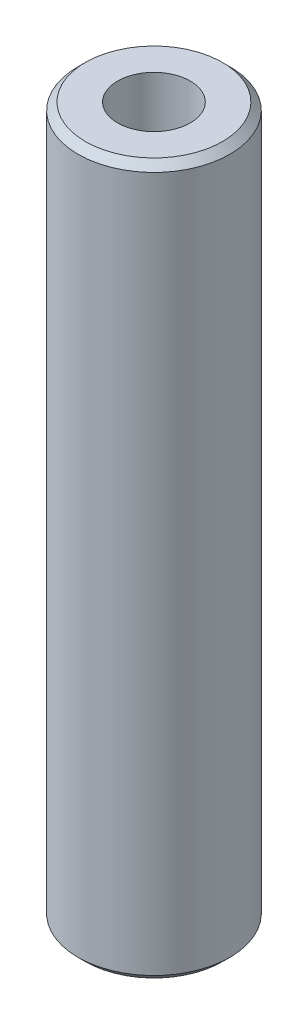
ISO-10303-21;
HEADER;
FILE_DESCRIPTION(('STEP AP214'),'2;1');
FILE_NAME('part.step','',(''),(''),'','','');
FILE_SCHEMA(('AUTOMOTIVE_DESIGN { 1 0 10303 214 1 1 1 1 }'));
ENDSEC;
DATA;
#1=APPLICATION_CONTEXT('core data for automotive mechanical design processes');
#2=APPLICATION_PROTOCOL_DEFINITION('international standard','automotive_design',2000,#1);
#3=PRODUCT_CONTEXT('',#1,'mechanical');
#4=PRODUCT('Part','Part','',(#3));
#5=PRODUCT_RELATED_PRODUCT_CATEGORY('part','',(#4));
#6=PRODUCT_DEFINITION_FORMATION('','',#4);
#7=PRODUCT_DEFINITION_CONTEXT('part definition',#1,'design');
#8=PRODUCT_DEFINITION('design','',#6,#7);
#9=PRODUCT_DEFINITION_SHAPE('','',#8);
#10=(LENGTH_UNIT() NAMED_UNIT(*) SI_UNIT(.MILLI.,.METRE.));
#11=(NAMED_UNIT(*) PLANE_ANGLE_UNIT() SI_UNIT($,.RADIAN.));
#12=(NAMED_UNIT(*) SI_UNIT($,.STERADIAN.) SOLID_ANGLE_UNIT());
#13=UNCERTAINTY_MEASURE_WITH_UNIT(LENGTH_MEASURE(1.E-05),#10,'distance_accuracy_value','');
#14=(GEOMETRIC_REPRESENTATION_CONTEXT(3) GLOBAL_UNCERTAINTY_ASSIGNED_CONTEXT((#13)) GLOBAL_UNIT_ASSIGNED_CONTEXT((#10,
#11,#12)) REPRESENTATION_CONTEXT('',''));
#15=CARTESIAN_POINT('',(0.,0.,0.));
#16=DIRECTION('',(0.,0.,1.));
#17=DIRECTION('',(1.,0.,0.));
#18=AXIS2_PLACEMENT_3D('',#15,#16,#17);
#19=CARTESIAN_POINT('',(0.,116.931307702913,0.));
#20=DIRECTION('',(0.,-1.,0.));
#21=DIRECTION('',(0.,0.,-1.));
#22=AXIS2_PLACEMENT_3D('',#19,#20,#21);
#23=CYLINDRICAL_SURFACE('',#22,12.5);
#24=CARTESIAN_POINT('',(0.,115.720614043958,0.));
#25=DIRECTION('',(0.,1.,0.));
#26=DIRECTION('',(0.,0.,1.));
#27=AXIS2_PLACEMENT_3D('',#24,#25,#26);
#28=CIRCLE('',#27,12.5);
#29=CARTESIAN_POINT('',(0.,115.720614043958,12.5));
#30=VERTEX_POINT('',#29);
#31=EDGE_CURVE('E50',#30,#30,#28,.F.);
#32=ORIENTED_EDGE('',*,*,#31,.T.);
#33=EDGE_LOOP('',(#32));
#34=FACE_BOUND('',#33,.T.);
#35=CARTESIAN_POINT('',(0.,1.21069365895433,0.));
#36=DIRECTION('',(0.,1.,0.));
#37=DIRECTION('',(0.,0.,1.));
#38=AXIS2_PLACEMENT_3D('',#35,#36,#37);
#39=CIRCLE('',#38,12.5);
#40=CARTESIAN_POINT('',(0.,1.21069365895433,12.5));
#41=VERTEX_POINT('',#40);
#42=EDGE_CURVE('E51',#41,#41,#39,.T.);
#43=ORIENTED_EDGE('',*,*,#42,.T.);
#44=EDGE_LOOP('',(#43));
#45=FACE_BOUND('',#44,.T.);
#46=ADVANCED_FACE('F39',(#34,#45),#23,.T.);
#47=CARTESIAN_POINT('',(0.,116.931307702913,0.));
#48=DIRECTION('',(0.,1.,0.));
#49=DIRECTION('',(0.,0.,1.));
#50=AXIS2_PLACEMENT_3D('',#47,#48,#49);
#51=PLANE('',#50);
#52=CARTESIAN_POINT('',(0.,116.931307702913,0.));
#53=DIRECTION('',(0.,1.,0.));
#54=DIRECTION('',(0.,0.,1.));
#55=AXIS2_PLACEMENT_3D('',#52,#53,#54);
#56=CIRCLE('',#55,11.2893063410457);
#57=CARTESIAN_POINT('',(0.,116.931307702913,11.2893063410457));
#58=VERTEX_POINT('',#57);
#59=EDGE_CURVE('E54',#58,#58,#56,.T.);
#60=ORIENTED_EDGE('',*,*,#59,.T.);
#61=EDGE_LOOP('',(#60));
#62=FACE_BOUND('',#61,.T.);
#63=CARTESIAN_POINT('',(0.,116.931307702913,0.));
#64=DIRECTION('',(0.,1.,0.));
#65=DIRECTION('',(0.,0.,1.));
#66=AXIS2_PLACEMENT_3D('',#63,#64,#65);
#67=CIRCLE('',#66,5.98408536010189);
#68=CARTESIAN_POINT('',(0.,116.931307702913,5.98408536010189));
#69=VERTEX_POINT('',#68);
#70=EDGE_CURVE('E58',#69,#69,#67,.T.);
#71=ORIENTED_EDGE('',*,*,#70,.F.);
#72=EDGE_LOOP('',(#71));
#73=FACE_BOUND('',#72,.T.);
#74=ADVANCED_FACE('F69',(#62,#73),#51,.T.);
#75=CARTESIAN_POINT('',(0.,0.,0.));
#76=DIRECTION('',(0.,1.,0.));
#77=DIRECTION('',(0.,0.,1.));
#78=AXIS2_PLACEMENT_3D('',#75,#76,#77);
#79=PLANE('',#78);
#80=CARTESIAN_POINT('',(0.,0.,0.));
#81=DIRECTION('',(0.,1.,0.));
#82=DIRECTION('',(0.,0.,1.));
#83=AXIS2_PLACEMENT_3D('',#80,#81,#82);
#84=CIRCLE('',#83,11.2893063410457);
#85=CARTESIAN_POINT('',(0.,0.,11.2893063410457));
#86=VERTEX_POINT('',#85);
#87=EDGE_CURVE('E10',#86,#86,#84,.F.);
#88=ORIENTED_EDGE('',*,*,#87,.T.);
#89=EDGE_LOOP('',(#88));
#90=FACE_BOUND('',#89,.T.);
#91=CARTESIAN_POINT('',(0.,0.,0.));
#92=DIRECTION('',(0.,1.,0.));
#93=DIRECTION('',(0.,0.,1.));
#94=AXIS2_PLACEMENT_3D('',#91,#92,#93);
#95=CIRCLE('',#94,5.98408536010189);
#96=CARTESIAN_POINT('',(0.,0.,5.98408536010189));
#97=VERTEX_POINT('',#96);
#98=EDGE_CURVE('E63',#97,#97,#95,.T.);
#99=ORIENTED_EDGE('',*,*,#98,.T.);
#100=EDGE_LOOP('',(#99));
#101=FACE_BOUND('',#100,.T.);
#102=ADVANCED_FACE('F75',(#90,#101),#79,.F.);
#103=CARTESIAN_POINT('',(0.,116.931307702913,0.));
#104=DIRECTION('',(0.,-1.,0.));
#105=DIRECTION('',(0.,0.,-1.));
#106=AXIS2_PLACEMENT_3D('',#103,#104,#105);
#107=CYLINDRICAL_SURFACE('',#106,5.98408536010189);
#108=ORIENTED_EDGE('',*,*,#70,.T.);
#109=EDGE_LOOP('',(#108));
#110=FACE_BOUND('',#109,.T.);
#111=ORIENTED_EDGE('',*,*,#98,.F.);
#112=EDGE_LOOP('',(#111));
#113=FACE_BOUND('',#112,.T.);
#114=ADVANCED_FACE('F70',(#110,#113),#107,.F.);
#115=CARTESIAN_POINT('',(0.,116.931307702913,0.));
#116=DIRECTION('',(0.,-1.,0.));
#117=DIRECTION('',(0.,0.,-1.));
#118=AXIS2_PLACEMENT_3D('',#115,#116,#117);
#119=CONICAL_SURFACE('',#118,11.2893063410457,0.785398163397443);
#120=ORIENTED_EDGE('',*,*,#31,.F.);
#121=EDGE_LOOP('',(#120));
#122=FACE_BOUND('',#121,.T.);
#123=ORIENTED_EDGE('',*,*,#59,.F.);
#124=EDGE_LOOP('',(#123));
#125=FACE_BOUND('',#124,.T.);
#126=ADVANCED_FACE('F81',(#122,#125),#119,.T.);
#127=CARTESIAN_POINT('',(0.,1.21069365895433,0.));
#128=DIRECTION('',(0.,1.,0.));
#129=DIRECTION('',(0.,0.,1.));
#130=AXIS2_PLACEMENT_3D('',#127,#128,#129);
#131=CONICAL_SURFACE('',#130,12.5,0.785398163397449);
#132=ORIENTED_EDGE('',*,*,#87,.F.);
#133=EDGE_LOOP('',(#132));
#134=FACE_BOUND('',#133,.T.);
#135=ORIENTED_EDGE('',*,*,#42,.F.);
#136=EDGE_LOOP('',(#135));
#137=FACE_BOUND('',#136,.T.);
#138=ADVANCED_FACE('F45',(#134,#137),#131,.T.);
#139=CLOSED_SHELL('',(#46,#74,#102,#114,#126,#138));
#140=MANIFOLD_SOLID_BREP('B2',#139);
#141=ADVANCED_BREP_SHAPE_REPRESENTATION('',(#18,#140),#14);
#142=SHAPE_DEFINITION_REPRESENTATION(#9,#141);
ENDSEC;
END-ISO-10303-21;
